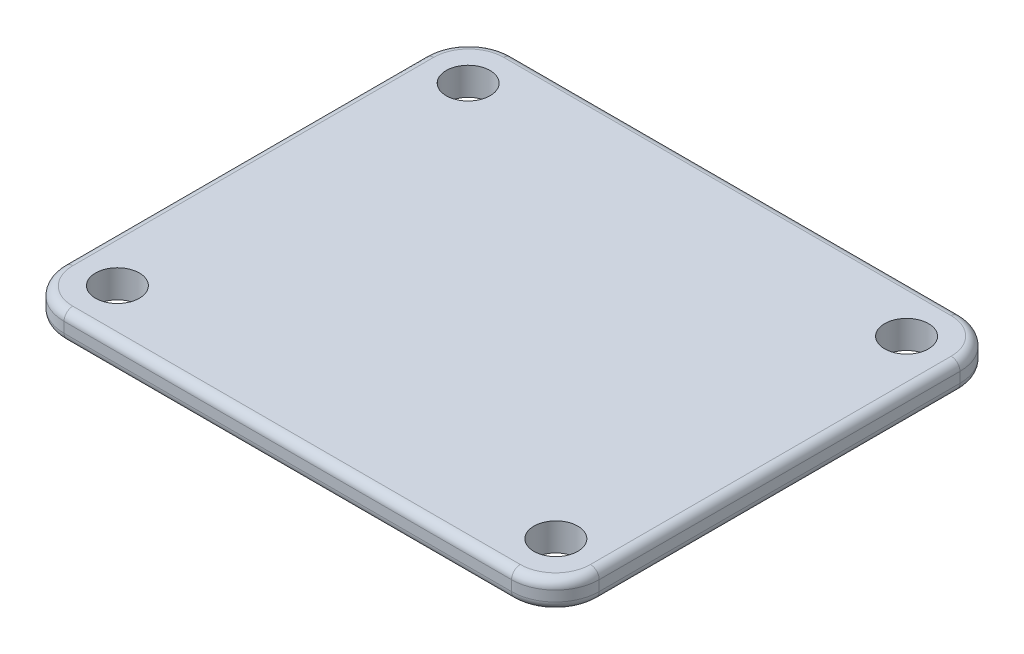
ISO-10303-21;
HEADER;
FILE_DESCRIPTION(('STEP AP214'),'2;1');
FILE_NAME('part.step','',(''),(''),'','','');
FILE_SCHEMA(('AUTOMOTIVE_DESIGN { 1 0 10303 214 1 1 1 1 }'));
ENDSEC;
DATA;
#1=APPLICATION_CONTEXT('core data for automotive mechanical design processes');
#2=APPLICATION_PROTOCOL_DEFINITION('international standard','automotive_design',2000,#1);
#3=PRODUCT_CONTEXT('',#1,'mechanical');
#4=PRODUCT('Part','Part','',(#3));
#5=PRODUCT_RELATED_PRODUCT_CATEGORY('part','',(#4));
#6=PRODUCT_DEFINITION_FORMATION('','',#4);
#7=PRODUCT_DEFINITION_CONTEXT('part definition',#1,'design');
#8=PRODUCT_DEFINITION('design','',#6,#7);
#9=PRODUCT_DEFINITION_SHAPE('','',#8);
#10=(LENGTH_UNIT() NAMED_UNIT(*) SI_UNIT(.MILLI.,.METRE.));
#11=(NAMED_UNIT(*) PLANE_ANGLE_UNIT() SI_UNIT($,.RADIAN.));
#12=(NAMED_UNIT(*) SI_UNIT($,.STERADIAN.) SOLID_ANGLE_UNIT());
#13=UNCERTAINTY_MEASURE_WITH_UNIT(LENGTH_MEASURE(1.E-05),#10,'distance_accuracy_value','');
#14=(GEOMETRIC_REPRESENTATION_CONTEXT(3) GLOBAL_UNCERTAINTY_ASSIGNED_CONTEXT((#13)) GLOBAL_UNIT_ASSIGNED_CONTEXT((#10,
#11,#12)) REPRESENTATION_CONTEXT('',''));
#15=CARTESIAN_POINT('',(0.,0.,0.));
#16=DIRECTION('',(0.,0.,1.));
#17=DIRECTION('',(1.,0.,0.));
#18=AXIS2_PLACEMENT_3D('',#15,#16,#17);
#19=CARTESIAN_POINT('',(-118.732669292731,3.175,-19.5533458649551));
#20=DIRECTION('',(0.,-1.,0.));
#21=DIRECTION('',(0.,0.,-1.));
#22=AXIS2_PLACEMENT_3D('',#19,#20,#21);
#23=PLANE('',#22);
#24=DIRECTION('',(0.,0.,1.));
#25=VECTOR('',#24,1.);
#26=CARTESIAN_POINT('',(-122.732669292731,3.175,-19.5533458649551));
#27=LINE('',#26,#25);
#28=CARTESIAN_POINT('',(-122.732669292731,3.175,-19.5533458649551));
#29=VERTEX_POINT('',#28);
#30=CARTESIAN_POINT('',(-122.732669292731,3.175,21.5906695744132));
#31=VERTEX_POINT('',#30);
#32=EDGE_CURVE('E47',#29,#31,#27,.T.);
#33=ORIENTED_EDGE('',*,*,#32,.T.);
#34=CARTESIAN_POINT('',(-118.732669292731,3.175,21.5906695744133));
#35=DIRECTION('',(0.,-1.,0.));
#36=DIRECTION('',(0.,0.,-1.));
#37=AXIS2_PLACEMENT_3D('',#34,#35,#36);
#38=CIRCLE('',#37,4.);
#39=CARTESIAN_POINT('',(-118.732509427102,3.175,25.5906695712186));
#40=VERTEX_POINT('',#39);
#41=EDGE_CURVE('E154',#31,#40,#38,.F.);
#42=ORIENTED_EDGE('',*,*,#41,.T.);
#43=DIRECTION('',(0.999999999201343,0.,-3.99664072472509E-05));
#44=VECTOR('',#43,1.);
#45=CARTESIAN_POINT('',(-118.730865048626,3.175,25.5906695054987));
#46=LINE('',#45,#44);
#47=CARTESIAN_POINT('',(-67.7014194049255,3.175,25.5886300418909));
#48=VERTEX_POINT('',#47);
#49=EDGE_CURVE('E178',#40,#48,#46,.T.);
#50=ORIENTED_EDGE('',*,*,#49,.T.);
#51=CARTESIAN_POINT('',(-67.7015792705544,3.175,21.5886300450855));
#52=DIRECTION('',(0.,-1.,0.));
#53=DIRECTION('',(0.,0.,-1.));
#54=AXIS2_PLACEMENT_3D('',#51,#52,#53);
#55=CIRCLE('',#54,4.);
#56=CARTESIAN_POINT('',(-63.7015792709717,3.175,21.5885722691979));
#57=VERTEX_POINT('',#56);
#58=EDGE_CURVE('E323',#48,#57,#55,.F.);
#59=ORIENTED_EDGE('',*,*,#58,.T.);
#60=DIRECTION('',(-1.44439718971546E-05,0.,-0.999999999895686));
#61=VECTOR('',#60,1.);
#62=CARTESIAN_POINT('',(-63.702173535162,3.175,-19.5541407238894));
#63=LINE('',#62,#61);
#64=CARTESIAN_POINT('',(-63.7021735269493,3.175,-19.5535721395091));
#65=VERTEX_POINT('',#64);
#66=EDGE_CURVE('E325',#57,#65,#63,.T.);
#67=ORIENTED_EDGE('',*,*,#66,.T.);
#68=CARTESIAN_POINT('',(-67.7021735265321,3.175,-19.5535143636215));
#69=DIRECTION('',(0.,-1.,0.));
#70=DIRECTION('',(0.,0.,-1.));
#71=AXIS2_PLACEMENT_3D('',#68,#69,#70);
#72=CIRCLE('',#71,4.);
#73=CARTESIAN_POINT('',(-67.7021867342162,3.175,-23.5535143635997));
#74=VERTEX_POINT('',#73);
#75=EDGE_CURVE('E327',#65,#74,#72,.F.);
#76=ORIENTED_EDGE('',*,*,#75,.T.);
#77=DIRECTION('',(-0.999999999994549,0.,3.30192101554651E-06));
#78=VECTOR('',#77,1.);
#79=CARTESIAN_POINT('',(-118.732682500415,3.175,-23.5533458649333));
#80=LINE('',#79,#78);
#81=CARTESIAN_POINT('',(-118.732682500415,3.175,-23.5533458649333));
#82=VERTEX_POINT('',#81);
#83=EDGE_CURVE('E329',#74,#82,#80,.T.);
#84=ORIENTED_EDGE('',*,*,#83,.T.);
#85=CARTESIAN_POINT('',(-118.732669292731,3.175,-19.5533458649551));
#86=DIRECTION('',(0.,-1.,0.));
#87=DIRECTION('',(0.,0.,-1.));
#88=AXIS2_PLACEMENT_3D('',#85,#86,#87);
#89=CIRCLE('',#88,4.);
#90=EDGE_CURVE('E52',#82,#29,#89,.F.);
#91=ORIENTED_EDGE('',*,*,#90,.T.);
#92=EDGE_LOOP('',(#33,#42,#50,#59,#67,#76,#84,#91));
#93=FACE_BOUND('',#92,.T.);
#94=CARTESIAN_POINT('',(-118.217169292731,3.175,21.0186489712735));
#95=DIRECTION('',(0.,1.,0.));
#96=DIRECTION('',(0.,0.,1.));
#97=AXIS2_PLACEMENT_3D('',#94,#95,#96);
#98=CIRCLE('',#97,2.49979863735303);
#99=CARTESIAN_POINT('',(-118.217169292731,3.175,23.5184476086265));
#100=VERTEX_POINT('',#99);
#101=EDGE_CURVE('E247',#100,#100,#98,.T.);
#102=ORIENTED_EDGE('',*,*,#101,.F.);
#103=EDGE_LOOP('',(#102));
#104=FACE_BOUND('',#103,.T.);
#105=CARTESIAN_POINT('',(-68.2176652646094,3.175,-18.9815126615054));
#106=DIRECTION('',(0.,1.,0.));
#107=DIRECTION('',(0.,0.,1.));
#108=AXIS2_PLACEMENT_3D('',#105,#106,#107);
#109=CIRCLE('',#108,2.49979863735303);
#110=CARTESIAN_POINT('',(-68.2176652646094,3.175,-16.4817140241524));
#111=VERTEX_POINT('',#110);
#112=EDGE_CURVE('E259',#111,#111,#109,.T.);
#113=ORIENTED_EDGE('',*,*,#112,.F.);
#114=EDGE_LOOP('',(#113));
#115=FACE_BOUND('',#114,.T.);
#116=CARTESIAN_POINT('',(-68.2170875322625,3.175,21.0166506476419));
#117=DIRECTION('',(0.,1.,0.));
#118=DIRECTION('',(0.,0.,1.));
#119=AXIS2_PLACEMENT_3D('',#116,#117,#118);
#120=CIRCLE('',#119,2.49979863735303);
#121=CARTESIAN_POINT('',(-68.2170875322625,3.175,23.5164492849949));
#122=VERTEX_POINT('',#121);
#123=EDGE_CURVE('E253',#122,#122,#120,.T.);
#124=ORIENTED_EDGE('',*,*,#123,.F.);
#125=EDGE_LOOP('',(#124));
#126=FACE_BOUND('',#125,.T.);
#127=CARTESIAN_POINT('',(-118.217169292731,3.175,-18.9813475670923));
#128=DIRECTION('',(0.,1.,0.));
#129=DIRECTION('',(0.,0.,1.));
#130=AXIS2_PLACEMENT_3D('',#127,#128,#129);
#131=CIRCLE('',#130,2.49979863735303);
#132=CARTESIAN_POINT('',(-118.217169292731,3.175,-16.4815489297393));
#133=VERTEX_POINT('',#132);
#134=EDGE_CURVE('E239',#133,#133,#131,.T.);
#135=ORIENTED_EDGE('',*,*,#134,.F.);
#136=EDGE_LOOP('',(#135));
#137=FACE_BOUND('',#136,.T.);
#138=ADVANCED_FACE('F30',(#93,#104,#115,#126,#137),#23,.F.);
#139=CARTESIAN_POINT('',(-118.732669292731,0.,-19.5533458649551));
#140=DIRECTION('',(0.,-1.,0.));
#141=DIRECTION('',(0.,0.,-1.));
#142=AXIS2_PLACEMENT_3D('',#139,#140,#141);
#143=PLANE('',#142);
#144=DIRECTION('',(0.999999999201343,0.,-3.99664072472509E-05));
#145=VECTOR('',#144,1.);
#146=CARTESIAN_POINT('',(-118.732509427102,0.,25.5906695712186));
#147=LINE('',#146,#145);
#148=CARTESIAN_POINT('',(-67.7014194049255,0.,25.5886300418909));
#149=VERTEX_POINT('',#148);
#150=CARTESIAN_POINT('',(-118.732509427102,0.,25.5906695712186));
#151=VERTEX_POINT('',#150);
#152=EDGE_CURVE('E281',#149,#151,#147,.F.);
#153=ORIENTED_EDGE('',*,*,#152,.T.);
#154=CARTESIAN_POINT('',(-118.732669292731,0.,21.5906695744133));
#155=DIRECTION('',(0.,-1.,0.));
#156=DIRECTION('',(0.,0.,-1.));
#157=AXIS2_PLACEMENT_3D('',#154,#155,#156);
#158=CIRCLE('',#157,4.);
#159=CARTESIAN_POINT('',(-122.732669292731,0.,21.5906695744132));
#160=VERTEX_POINT('',#159);
#161=EDGE_CURVE('E295',#151,#160,#158,.T.);
#162=ORIENTED_EDGE('',*,*,#161,.T.);
#163=DIRECTION('',(0.,0.,1.));
#164=VECTOR('',#163,1.);
#165=CARTESIAN_POINT('',(-122.732669292731,0.,-19.5533458649551));
#166=LINE('',#165,#164);
#167=CARTESIAN_POINT('',(-122.732669292731,0.,-19.5533458649551));
#168=VERTEX_POINT('',#167);
#169=EDGE_CURVE('E293',#160,#168,#166,.F.);
#170=ORIENTED_EDGE('',*,*,#169,.T.);
#171=CARTESIAN_POINT('',(-118.732669292731,0.,-19.5533458649551));
#172=DIRECTION('',(0.,-1.,0.));
#173=DIRECTION('',(0.,0.,-1.));
#174=AXIS2_PLACEMENT_3D('',#171,#172,#173);
#175=CIRCLE('',#174,4.);
#176=CARTESIAN_POINT('',(-118.732682500415,0.,-23.5533458649333));
#177=VERTEX_POINT('',#176);
#178=EDGE_CURVE('E291',#168,#177,#175,.T.);
#179=ORIENTED_EDGE('',*,*,#178,.T.);
#180=DIRECTION('',(-0.999999999994549,0.,3.30192101554651E-06));
#181=VECTOR('',#180,1.);
#182=CARTESIAN_POINT('',(-67.7021867342162,0.,-23.5535143635997));
#183=LINE('',#182,#181);
#184=CARTESIAN_POINT('',(-67.7021867342162,0.,-23.5535143635997));
#185=VERTEX_POINT('',#184);
#186=EDGE_CURVE('E289',#177,#185,#183,.F.);
#187=ORIENTED_EDGE('',*,*,#186,.T.);
#188=CARTESIAN_POINT('',(-67.7021735265321,0.,-19.5535143636215));
#189=DIRECTION('',(0.,-1.,0.));
#190=DIRECTION('',(0.,0.,-1.));
#191=AXIS2_PLACEMENT_3D('',#188,#189,#190);
#192=CIRCLE('',#191,4.);
#193=CARTESIAN_POINT('',(-63.7021735269493,0.,-19.5535721395091));
#194=VERTEX_POINT('',#193);
#195=EDGE_CURVE('E287',#185,#194,#192,.T.);
#196=ORIENTED_EDGE('',*,*,#195,.T.);
#197=DIRECTION('',(-1.44439718971546E-05,0.,-0.999999999895686));
#198=VECTOR('',#197,1.);
#199=CARTESIAN_POINT('',(-63.7015792709717,0.,21.5885722691979));
#200=LINE('',#199,#198);
#201=CARTESIAN_POINT('',(-63.7015792709717,0.,21.5885722691979));
#202=VERTEX_POINT('',#201);
#203=EDGE_CURVE('E285',#194,#202,#200,.F.);
#204=ORIENTED_EDGE('',*,*,#203,.T.);
#205=CARTESIAN_POINT('',(-67.7015792705544,0.,21.5886300450855));
#206=DIRECTION('',(0.,-1.,0.));
#207=DIRECTION('',(0.,0.,-1.));
#208=AXIS2_PLACEMENT_3D('',#205,#206,#207);
#209=CIRCLE('',#208,4.);
#210=EDGE_CURVE('E283',#202,#149,#209,.T.);
#211=ORIENTED_EDGE('',*,*,#210,.T.);
#212=EDGE_LOOP('',(#153,#162,#170,#179,#187,#196,#204,#211));
#213=FACE_BOUND('',#212,.T.);
#214=CARTESIAN_POINT('',(-118.217169292731,0.,21.0186489712735));
#215=DIRECTION('',(0.,1.,0.));
#216=DIRECTION('',(0.,0.,1.));
#217=AXIS2_PLACEMENT_3D('',#214,#215,#216);
#218=CIRCLE('',#217,2.49979863735303);
#219=CARTESIAN_POINT('',(-118.217169292731,0.,23.5184476086265));
#220=VERTEX_POINT('',#219);
#221=EDGE_CURVE('E244',#220,#220,#218,.T.);
#222=ORIENTED_EDGE('',*,*,#221,.T.);
#223=EDGE_LOOP('',(#222));
#224=FACE_BOUND('',#223,.T.);
#225=CARTESIAN_POINT('',(-68.2176652646094,0.,-18.9815126615054));
#226=DIRECTION('',(0.,1.,0.));
#227=DIRECTION('',(0.,0.,1.));
#228=AXIS2_PLACEMENT_3D('',#225,#226,#227);
#229=CIRCLE('',#228,2.49979863735303);
#230=CARTESIAN_POINT('',(-68.2176652646094,0.,-16.4817140241524));
#231=VERTEX_POINT('',#230);
#232=EDGE_CURVE('E256',#231,#231,#229,.T.);
#233=ORIENTED_EDGE('',*,*,#232,.T.);
#234=EDGE_LOOP('',(#233));
#235=FACE_BOUND('',#234,.T.);
#236=CARTESIAN_POINT('',(-68.2170875322625,0.,21.0166506476419));
#237=DIRECTION('',(0.,1.,0.));
#238=DIRECTION('',(0.,0.,1.));
#239=AXIS2_PLACEMENT_3D('',#236,#237,#238);
#240=CIRCLE('',#239,2.49979863735303);
#241=CARTESIAN_POINT('',(-68.2170875322625,0.,23.5164492849949));
#242=VERTEX_POINT('',#241);
#243=EDGE_CURVE('E250',#242,#242,#240,.T.);
#244=ORIENTED_EDGE('',*,*,#243,.T.);
#245=EDGE_LOOP('',(#244));
#246=FACE_BOUND('',#245,.T.);
#247=CARTESIAN_POINT('',(-118.217169292731,0.,-18.9813475670923));
#248=DIRECTION('',(0.,1.,0.));
#249=DIRECTION('',(0.,0.,1.));
#250=AXIS2_PLACEMENT_3D('',#247,#248,#249);
#251=CIRCLE('',#250,2.49979863735303);
#252=CARTESIAN_POINT('',(-118.217169292731,0.,-16.4815489297393));
#253=VERTEX_POINT('',#252);
#254=EDGE_CURVE('E233',#253,#253,#251,.T.);
#255=ORIENTED_EDGE('',*,*,#254,.T.);
#256=EDGE_LOOP('',(#255));
#257=FACE_BOUND('',#256,.T.);
#258=ADVANCED_FACE('F379',(#213,#224,#235,#246,#257),#143,.T.);
#259=CARTESIAN_POINT('',(-118.732669292731,3.175,-19.5533458649551));
#260=DIRECTION('',(0.,-1.,0.));
#261=DIRECTION('',(0.,0.,-1.));
#262=AXIS2_PLACEMENT_3D('',#259,#260,#261);
#263=CYLINDRICAL_SURFACE('',#262,5.);
#264=DIRECTION('',(0.,-1.,0.));
#265=VECTOR('',#264,1.);
#266=CARTESIAN_POINT('',(-118.732685802336,3.175,-24.5533458649279));
#267=LINE('',#266,#265);
#268=CARTESIAN_POINT('',(-118.732685802336,2.175,-24.5533458649279));
#269=VERTEX_POINT('',#268);
#270=CARTESIAN_POINT('',(-118.732685802336,1.,-24.5533458649279));
#271=VERTEX_POINT('',#270);
#272=EDGE_CURVE('E262',#269,#271,#267,.T.);
#273=ORIENTED_EDGE('',*,*,#272,.T.);
#274=CARTESIAN_POINT('',(-118.732669292731,1.,-19.5533458649551));
#275=DIRECTION('',(0.,-1.,0.));
#276=DIRECTION('',(0.,0.,-1.));
#277=AXIS2_PLACEMENT_3D('',#274,#275,#276);
#278=CIRCLE('',#277,5.);
#279=CARTESIAN_POINT('',(-123.732669292731,1.,-19.5533458649551));
#280=VERTEX_POINT('',#279);
#281=EDGE_CURVE('E304',#271,#280,#278,.F.);
#282=ORIENTED_EDGE('',*,*,#281,.T.);
#283=DIRECTION('',(0.,-1.,0.));
#284=VECTOR('',#283,1.);
#285=CARTESIAN_POINT('',(-123.732669292731,3.175,-19.5533458649551));
#286=LINE('',#285,#284);
#287=CARTESIAN_POINT('',(-123.732669292731,2.175,-19.5533458649551));
#288=VERTEX_POINT('',#287);
#289=EDGE_CURVE('E175',#288,#280,#286,.T.);
#290=ORIENTED_EDGE('',*,*,#289,.F.);
#291=CARTESIAN_POINT('',(-118.732669292731,2.175,-19.5533458649551));
#292=DIRECTION('',(0.,-1.,0.));
#293=DIRECTION('',(0.,0.,-1.));
#294=AXIS2_PLACEMENT_3D('',#291,#292,#293);
#295=CIRCLE('',#294,5.);
#296=EDGE_CURVE('E302',#288,#269,#295,.T.);
#297=ORIENTED_EDGE('',*,*,#296,.T.);
#298=EDGE_LOOP('',(#273,#282,#290,#297));
#299=FACE_BOUND('',#298,.T.);
#300=ADVANCED_FACE('F355',(#299),#263,.T.);
#301=CARTESIAN_POINT('',(-123.732669292731,3.175,21.5906695744132));
#302=DIRECTION('',(1.,0.,0.));
#303=DIRECTION('',(0.,0.,-1.));
#304=AXIS2_PLACEMENT_3D('',#301,#302,#303);
#305=PLANE('',#304);
#306=ORIENTED_EDGE('',*,*,#289,.T.);
#307=DIRECTION('',(0.,0.,1.));
#308=VECTOR('',#307,1.);
#309=CARTESIAN_POINT('',(-123.732669292731,1.,21.5906695744132));
#310=LINE('',#309,#308);
#311=CARTESIAN_POINT('',(-123.732669292731,1.,21.5906695744132));
#312=VERTEX_POINT('',#311);
#313=EDGE_CURVE('E300',#280,#312,#310,.T.);
#314=ORIENTED_EDGE('',*,*,#313,.T.);
#315=DIRECTION('',(0.,-1.,0.));
#316=VECTOR('',#315,1.);
#317=CARTESIAN_POINT('',(-123.732669292731,3.175,21.5906695744132));
#318=LINE('',#317,#316);
#319=CARTESIAN_POINT('',(-123.732669292731,2.175,21.5906695744132));
#320=VERTEX_POINT('',#319);
#321=EDGE_CURVE('E166',#320,#312,#318,.T.);
#322=ORIENTED_EDGE('',*,*,#321,.F.);
#323=DIRECTION('',(0.,0.,1.));
#324=VECTOR('',#323,1.);
#325=CARTESIAN_POINT('',(-123.732669292731,2.175,21.5906695744132));
#326=LINE('',#325,#324);
#327=EDGE_CURVE('E298',#320,#288,#326,.F.);
#328=ORIENTED_EDGE('',*,*,#327,.T.);
#329=EDGE_LOOP('',(#306,#314,#322,#328));
#330=FACE_BOUND('',#329,.T.);
#331=ADVANCED_FACE('F352',(#330),#305,.F.);
#332=CARTESIAN_POINT('',(-118.732669292731,3.175,21.5906695744133));
#333=DIRECTION('',(0.,-1.,0.));
#334=DIRECTION('',(0.,0.,-1.));
#335=AXIS2_PLACEMENT_3D('',#332,#333,#334);
#336=CYLINDRICAL_SURFACE('',#335,5.);
#337=ORIENTED_EDGE('',*,*,#321,.T.);
#338=CARTESIAN_POINT('',(-118.732669292731,1.,21.5906695744133));
#339=DIRECTION('',(0.,-1.,0.));
#340=DIRECTION('',(0.,0.,-1.));
#341=AXIS2_PLACEMENT_3D('',#338,#339,#340);
#342=CIRCLE('',#341,5.);
#343=CARTESIAN_POINT('',(-118.732469460695,1.,26.59066957042));
#344=VERTEX_POINT('',#343);
#345=EDGE_CURVE('E165',#312,#344,#342,.F.);
#346=ORIENTED_EDGE('',*,*,#345,.T.);
#347=DIRECTION('',(0.,-1.,0.));
#348=VECTOR('',#347,1.);
#349=CARTESIAN_POINT('',(-118.732469460695,3.175,26.59066957042));
#350=LINE('',#349,#348);
#351=CARTESIAN_POINT('',(-118.732469460695,2.175,26.59066957042));
#352=VERTEX_POINT('',#351);
#353=EDGE_CURVE('E147',#352,#344,#350,.T.);
#354=ORIENTED_EDGE('',*,*,#353,.F.);
#355=CARTESIAN_POINT('',(-118.732669292731,2.175,21.5906695744133));
#356=DIRECTION('',(0.,-1.,0.));
#357=DIRECTION('',(0.,0.,-1.));
#358=AXIS2_PLACEMENT_3D('',#355,#356,#357);
#359=CIRCLE('',#358,5.);
#360=EDGE_CURVE('E162',#352,#320,#359,.T.);
#361=ORIENTED_EDGE('',*,*,#360,.T.);
#362=EDGE_LOOP('',(#337,#346,#354,#361));
#363=FACE_BOUND('',#362,.T.);
#364=ADVANCED_FACE('F161',(#363),#336,.T.);
#365=CARTESIAN_POINT('',(-67.7013794385182,3.175,26.5886300410922));
#366=DIRECTION('',(-3.99664072472509E-05,0.,-0.999999999201343));
#367=DIRECTION('',(-0.999999999201343,0.,3.99664072472509E-05));
#368=AXIS2_PLACEMENT_3D('',#365,#366,#367);
#369=PLANE('',#368);
#370=ORIENTED_EDGE('',*,*,#353,.T.);
#371=DIRECTION('',(0.999999999201343,0.,-3.99664072472509E-05));
#372=VECTOR('',#371,1.);
#373=CARTESIAN_POINT('',(-67.7013794385182,1.,26.5886300410922));
#374=LINE('',#373,#372);
#375=CARTESIAN_POINT('',(-67.7013794385182,1.,26.5886300410922));
#376=VERTEX_POINT('',#375);
#377=EDGE_CURVE('E11',#344,#376,#374,.T.);
#378=ORIENTED_EDGE('',*,*,#377,.T.);
#379=DIRECTION('',(0.,-1.,0.));
#380=VECTOR('',#379,1.);
#381=CARTESIAN_POINT('',(-67.7013794385182,3.175,26.5886300410922));
#382=LINE('',#381,#380);
#383=CARTESIAN_POINT('',(-67.7013794385182,2.175,26.5886300410922));
#384=VERTEX_POINT('',#383);
#385=EDGE_CURVE('E149',#384,#376,#382,.T.);
#386=ORIENTED_EDGE('',*,*,#385,.F.);
#387=DIRECTION('',(0.999999999201343,0.,-3.99664072472509E-05));
#388=VECTOR('',#387,1.);
#389=CARTESIAN_POINT('',(-67.7013794385182,2.175,26.5886300410922));
#390=LINE('',#389,#388);
#391=EDGE_CURVE('E39',#384,#352,#390,.F.);
#392=ORIENTED_EDGE('',*,*,#391,.T.);
#393=EDGE_LOOP('',(#370,#378,#386,#392));
#394=FACE_BOUND('',#393,.T.);
#395=ADVANCED_FACE('F146',(#394),#369,.F.);
#396=CARTESIAN_POINT('',(-67.7015792705544,3.175,21.5886300450855));
#397=DIRECTION('',(0.,-1.,0.));
#398=DIRECTION('',(0.,0.,-1.));
#399=AXIS2_PLACEMENT_3D('',#396,#397,#398);
#400=CYLINDRICAL_SURFACE('',#399,5.);
#401=ORIENTED_EDGE('',*,*,#385,.T.);
#402=CARTESIAN_POINT('',(-67.7015792705544,1.,21.5886300450855));
#403=DIRECTION('',(0.,-1.,0.));
#404=DIRECTION('',(0.,0.,-1.));
#405=AXIS2_PLACEMENT_3D('',#402,#403,#404);
#406=CIRCLE('',#405,5.);
#407=CARTESIAN_POINT('',(-62.701579271076,1.,21.588557825226));
#408=VERTEX_POINT('',#407);
#409=EDGE_CURVE('E320',#376,#408,#406,.F.);
#410=ORIENTED_EDGE('',*,*,#409,.T.);
#411=DIRECTION('',(0.,-1.,0.));
#412=VECTOR('',#411,1.);
#413=CARTESIAN_POINT('',(-62.701579271076,3.175,21.588557825226));
#414=LINE('',#413,#412);
#415=CARTESIAN_POINT('',(-62.701579271076,2.175,21.588557825226));
#416=VERTEX_POINT('',#415);
#417=EDGE_CURVE('E273',#416,#408,#414,.T.);
#418=ORIENTED_EDGE('',*,*,#417,.F.);
#419=CARTESIAN_POINT('',(-67.7015792705544,2.175,21.5886300450855));
#420=DIRECTION('',(0.,-1.,0.));
#421=DIRECTION('',(0.,0.,-1.));
#422=AXIS2_PLACEMENT_3D('',#419,#420,#421);
#423=CIRCLE('',#422,5.);
#424=EDGE_CURVE('E318',#416,#384,#423,.T.);
#425=ORIENTED_EDGE('',*,*,#424,.T.);
#426=EDGE_LOOP('',(#401,#410,#418,#425));
#427=FACE_BOUND('',#426,.T.);
#428=ADVANCED_FACE('F402',(#427),#400,.T.);
#429=CARTESIAN_POINT('',(-62.7021735270537,3.175,-19.553586583481));
#430=DIRECTION('',(-0.999999999895686,0.,1.44439718971546E-05));
#431=DIRECTION('',(1.44439718971546E-05,0.,0.999999999895686));
#432=AXIS2_PLACEMENT_3D('',#429,#430,#431);
#433=PLANE('',#432);
#434=ORIENTED_EDGE('',*,*,#417,.T.);
#435=DIRECTION('',(-1.44439718971546E-05,0.,-0.999999999895686));
#436=VECTOR('',#435,1.);
#437=CARTESIAN_POINT('',(-62.7021735270537,1.,-19.553586583481));
#438=LINE('',#437,#436);
#439=CARTESIAN_POINT('',(-62.7021735270537,1.,-19.553586583481));
#440=VERTEX_POINT('',#439);
#441=EDGE_CURVE('E316',#408,#440,#438,.T.);
#442=ORIENTED_EDGE('',*,*,#441,.T.);
#443=DIRECTION('',(0.,-1.,0.));
#444=VECTOR('',#443,1.);
#445=CARTESIAN_POINT('',(-62.7021735270537,3.175,-19.553586583481));
#446=LINE('',#445,#444);
#447=CARTESIAN_POINT('',(-62.7021735270537,2.175,-19.553586583481));
#448=VERTEX_POINT('',#447);
#449=EDGE_CURVE('E270',#448,#440,#446,.T.);
#450=ORIENTED_EDGE('',*,*,#449,.F.);
#451=DIRECTION('',(-1.44439718971546E-05,0.,-0.999999999895686));
#452=VECTOR('',#451,1.);
#453=CARTESIAN_POINT('',(-62.7021735270537,2.175,-19.553586583481));
#454=LINE('',#453,#452);
#455=EDGE_CURVE('E314',#448,#416,#454,.F.);
#456=ORIENTED_EDGE('',*,*,#455,.T.);
#457=EDGE_LOOP('',(#434,#442,#450,#456));
#458=FACE_BOUND('',#457,.T.);
#459=ADVANCED_FACE('F398',(#458),#433,.F.);
#460=CARTESIAN_POINT('',(-67.7021735265321,3.175,-19.5535143636215));
#461=DIRECTION('',(0.,-1.,0.));
#462=DIRECTION('',(0.,0.,-1.));
#463=AXIS2_PLACEMENT_3D('',#460,#461,#462);
#464=CYLINDRICAL_SURFACE('',#463,5.);
#465=ORIENTED_EDGE('',*,*,#449,.T.);
#466=CARTESIAN_POINT('',(-67.7021735265321,1.,-19.5535143636215));
#467=DIRECTION('',(0.,-1.,0.));
#468=DIRECTION('',(0.,0.,-1.));
#469=AXIS2_PLACEMENT_3D('',#466,#467,#468);
#470=CIRCLE('',#469,5.);
#471=CARTESIAN_POINT('',(-67.7021900361372,1.,-24.5535143635943));
#472=VERTEX_POINT('',#471);
#473=EDGE_CURVE('E312',#440,#472,#470,.F.);
#474=ORIENTED_EDGE('',*,*,#473,.T.);
#475=DIRECTION('',(0.,-1.,0.));
#476=VECTOR('',#475,1.);
#477=CARTESIAN_POINT('',(-67.7021900361372,3.175,-24.5535143635943));
#478=LINE('',#477,#476);
#479=CARTESIAN_POINT('',(-67.7021900361372,2.175,-24.5535143635943));
#480=VERTEX_POINT('',#479);
#481=EDGE_CURVE('E267',#480,#472,#478,.T.);
#482=ORIENTED_EDGE('',*,*,#481,.F.);
#483=CARTESIAN_POINT('',(-67.7021735265321,2.175,-19.5535143636215));
#484=DIRECTION('',(0.,-1.,0.));
#485=DIRECTION('',(0.,0.,-1.));
#486=AXIS2_PLACEMENT_3D('',#483,#484,#485);
#487=CIRCLE('',#486,5.);
#488=EDGE_CURVE('E310',#480,#448,#487,.T.);
#489=ORIENTED_EDGE('',*,*,#488,.T.);
#490=EDGE_LOOP('',(#465,#474,#482,#489));
#491=FACE_BOUND('',#490,.T.);
#492=ADVANCED_FACE('F394',(#491),#464,.T.);
#493=CARTESIAN_POINT('',(-118.732685802336,3.175,-24.5533458649279));
#494=DIRECTION('',(3.30192101554651E-06,0.,0.999999999994549));
#495=DIRECTION('',(0.999999999994549,0.,-3.30192101554651E-06));
#496=AXIS2_PLACEMENT_3D('',#493,#494,#495);
#497=PLANE('',#496);
#498=ORIENTED_EDGE('',*,*,#481,.T.);
#499=DIRECTION('',(-0.999999999994549,0.,3.30192101554651E-06));
#500=VECTOR('',#499,1.);
#501=CARTESIAN_POINT('',(-118.732685802336,1.,-24.5533458649279));
#502=LINE('',#501,#500);
#503=EDGE_CURVE('E308',#472,#271,#502,.T.);
#504=ORIENTED_EDGE('',*,*,#503,.T.);
#505=ORIENTED_EDGE('',*,*,#272,.F.);
#506=DIRECTION('',(-0.999999999994549,0.,3.30192101554651E-06));
#507=VECTOR('',#506,1.);
#508=CARTESIAN_POINT('',(-118.732685802336,2.175,-24.5533458649279));
#509=LINE('',#508,#507);
#510=EDGE_CURVE('E306',#269,#480,#509,.F.);
#511=ORIENTED_EDGE('',*,*,#510,.T.);
#512=EDGE_LOOP('',(#498,#504,#505,#511));
#513=FACE_BOUND('',#512,.T.);
#514=ADVANCED_FACE('F391',(#513),#497,.F.);
#515=CARTESIAN_POINT('',(-68.2176652646094,3.175,-18.9815126615054));
#516=DIRECTION('',(0.,-1.,0.));
#517=DIRECTION('',(0.,0.,-1.));
#518=AXIS2_PLACEMENT_3D('',#515,#516,#517);
#519=CYLINDRICAL_SURFACE('',#518,2.49979863735303);
#520=ORIENTED_EDGE('',*,*,#112,.T.);
#521=EDGE_LOOP('',(#520));
#522=FACE_BOUND('',#521,.T.);
#523=ORIENTED_EDGE('',*,*,#232,.F.);
#524=EDGE_LOOP('',(#523));
#525=FACE_BOUND('',#524,.T.);
#526=ADVANCED_FACE('F388',(#522,#525),#519,.F.);
#527=CARTESIAN_POINT('',(-68.2170875322625,3.175,21.0166506476419));
#528=DIRECTION('',(0.,-1.,0.));
#529=DIRECTION('',(0.,0.,-1.));
#530=AXIS2_PLACEMENT_3D('',#527,#528,#529);
#531=CYLINDRICAL_SURFACE('',#530,2.49979863735303);
#532=ORIENTED_EDGE('',*,*,#123,.T.);
#533=EDGE_LOOP('',(#532));
#534=FACE_BOUND('',#533,.T.);
#535=ORIENTED_EDGE('',*,*,#243,.F.);
#536=EDGE_LOOP('',(#535));
#537=FACE_BOUND('',#536,.T.);
#538=ADVANCED_FACE('F593',(#534,#537),#531,.F.);
#539=CARTESIAN_POINT('',(-118.217169292731,3.175,21.0186489712735));
#540=DIRECTION('',(0.,-1.,0.));
#541=DIRECTION('',(0.,0.,-1.));
#542=AXIS2_PLACEMENT_3D('',#539,#540,#541);
#543=CYLINDRICAL_SURFACE('',#542,2.49979863735303);
#544=ORIENTED_EDGE('',*,*,#101,.T.);
#545=EDGE_LOOP('',(#544));
#546=FACE_BOUND('',#545,.T.);
#547=ORIENTED_EDGE('',*,*,#221,.F.);
#548=EDGE_LOOP('',(#547));
#549=FACE_BOUND('',#548,.T.);
#550=ADVANCED_FACE('F595',(#546,#549),#543,.F.);
#551=CARTESIAN_POINT('',(-118.217169292731,3.175,-18.9813475670923));
#552=DIRECTION('',(0.,-1.,0.));
#553=DIRECTION('',(0.,0.,-1.));
#554=AXIS2_PLACEMENT_3D('',#551,#552,#553);
#555=CYLINDRICAL_SURFACE('',#554,2.49979863735303);
#556=ORIENTED_EDGE('',*,*,#134,.T.);
#557=EDGE_LOOP('',(#556));
#558=FACE_BOUND('',#557,.T.);
#559=ORIENTED_EDGE('',*,*,#254,.F.);
#560=EDGE_LOOP('',(#559));
#561=FACE_BOUND('',#560,.T.);
#562=ADVANCED_FACE('F455',(#558,#561),#555,.F.);
#563=CARTESIAN_POINT('',(-67.7021735265321,1.,-19.5535143636215));
#564=DIRECTION('',(0.,-1.,0.));
#565=DIRECTION('',(0.,0.,-1.));
#566=AXIS2_PLACEMENT_3D('',#563,#564,#565);
#567=TOROIDAL_SURFACE('',#566,4.,1.);
#568=CARTESIAN_POINT('',(-63.7021735269494,1.,-19.5535721395091));
#569=DIRECTION('',(1.44439718900712E-05,0.,0.999999999895686));
#570=DIRECTION('',(0.999999999895686,0.,-1.44439718900712E-05));
#571=AXIS2_PLACEMENT_3D('',#568,#569,#570);
#572=CIRCLE('',#571,1.);
#573=EDGE_CURVE('E226',#194,#440,#572,.T.);
#574=ORIENTED_EDGE('',*,*,#573,.F.);
#575=ORIENTED_EDGE('',*,*,#195,.F.);
#576=CARTESIAN_POINT('',(-67.7021867342162,1.,-23.5535143635997));
#577=DIRECTION('',(-0.999999999994549,0.,3.30192102826476E-06));
#578=DIRECTION('',(3.30192102826476E-06,0.,0.999999999994549));
#579=AXIS2_PLACEMENT_3D('',#576,#577,#578);
#580=CIRCLE('',#579,1.);
#581=EDGE_CURVE('E183',#472,#185,#580,.T.);
#582=ORIENTED_EDGE('',*,*,#581,.F.);
#583=ORIENTED_EDGE('',*,*,#473,.F.);
#584=EDGE_LOOP('',(#574,#575,#582,#583));
#585=FACE_BOUND('',#584,.T.);
#586=ADVANCED_FACE('F449',(#585),#567,.T.);
#587=CARTESIAN_POINT('',(-118.732682500415,1.,-23.5533458649333));
#588=DIRECTION('',(0.999999999994549,0.,-3.30192101554651E-06));
#589=DIRECTION('',(-3.30192101554651E-06,0.,-0.999999999994549));
#590=AXIS2_PLACEMENT_3D('',#587,#588,#589);
#591=CYLINDRICAL_SURFACE('',#590,1.);
#592=ORIENTED_EDGE('',*,*,#581,.T.);
#593=ORIENTED_EDGE('',*,*,#186,.F.);
#594=CARTESIAN_POINT('',(-118.732682500415,1.,-23.5533458649333));
#595=DIRECTION('',(-0.999999999994549,0.,3.30192101438697E-06));
#596=DIRECTION('',(3.30192101438697E-06,0.,0.999999999994549));
#597=AXIS2_PLACEMENT_3D('',#594,#595,#596);
#598=CIRCLE('',#597,1.);
#599=EDGE_CURVE('E224',#271,#177,#598,.T.);
#600=ORIENTED_EDGE('',*,*,#599,.F.);
#601=ORIENTED_EDGE('',*,*,#503,.F.);
#602=EDGE_LOOP('',(#592,#593,#600,#601));
#603=FACE_BOUND('',#602,.T.);
#604=ADVANCED_FACE('F454',(#603),#591,.T.);
#605=CARTESIAN_POINT('',(-63.7021735269493,1.,-19.5535721395091));
#606=DIRECTION('',(1.44439718971546E-05,0.,0.999999999895686));
#607=DIRECTION('',(0.999999999895686,0.,-1.44439718971546E-05));
#608=AXIS2_PLACEMENT_3D('',#605,#606,#607);
#609=CYLINDRICAL_SURFACE('',#608,1.);
#610=ORIENTED_EDGE('',*,*,#573,.T.);
#611=ORIENTED_EDGE('',*,*,#441,.F.);
#612=CARTESIAN_POINT('',(-63.7015792709717,1.,21.5885722691979));
#613=DIRECTION('',(1.44439718970103E-05,0.,0.999999999895686));
#614=DIRECTION('',(0.999999999895686,0.,-1.44439718970103E-05));
#615=AXIS2_PLACEMENT_3D('',#612,#613,#614);
#616=CIRCLE('',#615,1.);
#617=EDGE_CURVE('E221',#202,#408,#616,.T.);
#618=ORIENTED_EDGE('',*,*,#617,.F.);
#619=ORIENTED_EDGE('',*,*,#203,.F.);
#620=EDGE_LOOP('',(#610,#611,#618,#619));
#621=FACE_BOUND('',#620,.T.);
#622=ADVANCED_FACE('F467',(#621),#609,.T.);
#623=CARTESIAN_POINT('',(-118.732669292731,1.,-19.5533458649551));
#624=DIRECTION('',(0.,-1.,0.));
#625=DIRECTION('',(0.,0.,-1.));
#626=AXIS2_PLACEMENT_3D('',#623,#624,#625);
#627=TOROIDAL_SURFACE('',#626,4.,1.);
#628=ORIENTED_EDGE('',*,*,#599,.T.);
#629=ORIENTED_EDGE('',*,*,#178,.F.);
#630=CARTESIAN_POINT('',(-122.732669292731,1.,-19.5533458649551));
#631=DIRECTION('',(0.,0.,1.));
#632=DIRECTION('',(0.,-1.,0.));
#633=AXIS2_PLACEMENT_3D('',#630,#631,#632);
#634=CIRCLE('',#633,1.);
#635=EDGE_CURVE('E218',#280,#168,#634,.T.);
#636=ORIENTED_EDGE('',*,*,#635,.F.);
#637=ORIENTED_EDGE('',*,*,#281,.F.);
#638=EDGE_LOOP('',(#628,#629,#636,#637));
#639=FACE_BOUND('',#638,.T.);
#640=ADVANCED_FACE('F360',(#639),#627,.T.);
#641=CARTESIAN_POINT('',(-67.7015792705544,1.,21.5886300450855));
#642=DIRECTION('',(0.,-1.,0.));
#643=DIRECTION('',(0.,0.,-1.));
#644=AXIS2_PLACEMENT_3D('',#641,#642,#643);
#645=TOROIDAL_SURFACE('',#644,4.,1.);
#646=ORIENTED_EDGE('',*,*,#617,.T.);
#647=ORIENTED_EDGE('',*,*,#409,.F.);
#648=CARTESIAN_POINT('',(-67.7014194049255,1.,25.5886300418909));
#649=DIRECTION('',(-0.999999999201343,0.,3.99664072392447E-05));
#650=DIRECTION('',(3.99664072392447E-05,0.,0.999999999201343));
#651=AXIS2_PLACEMENT_3D('',#648,#649,#650);
#652=CIRCLE('',#651,1.);
#653=EDGE_CURVE('E213',#149,#376,#652,.T.);
#654=ORIENTED_EDGE('',*,*,#653,.F.);
#655=ORIENTED_EDGE('',*,*,#210,.F.);
#656=EDGE_LOOP('',(#646,#647,#654,#655));
#657=FACE_BOUND('',#656,.T.);
#658=ADVANCED_FACE('F484',(#657),#645,.T.);
#659=CARTESIAN_POINT('',(-122.732669292731,1.,21.5906695744132));
#660=DIRECTION('',(0.,0.,-1.));
#661=DIRECTION('',(-1.,0.,0.));
#662=AXIS2_PLACEMENT_3D('',#659,#660,#661);
#663=CYLINDRICAL_SURFACE('',#662,1.);
#664=ORIENTED_EDGE('',*,*,#635,.T.);
#665=ORIENTED_EDGE('',*,*,#169,.F.);
#666=CARTESIAN_POINT('',(-122.732669292731,1.,21.5906695744132));
#667=DIRECTION('',(0.,0.,1.));
#668=DIRECTION('',(0.,-1.,0.));
#669=AXIS2_PLACEMENT_3D('',#666,#667,#668);
#670=CIRCLE('',#669,1.);
#671=EDGE_CURVE('E207',#312,#160,#670,.T.);
#672=ORIENTED_EDGE('',*,*,#671,.F.);
#673=ORIENTED_EDGE('',*,*,#313,.F.);
#674=EDGE_LOOP('',(#664,#665,#672,#673));
#675=FACE_BOUND('',#674,.T.);
#676=ADVANCED_FACE('F366',(#675),#663,.T.);
#677=CARTESIAN_POINT('',(-67.7014194049255,1.,25.5886300418909));
#678=DIRECTION('',(-0.999999999201343,0.,3.99664072472509E-05));
#679=DIRECTION('',(3.99664072472509E-05,0.,0.999999999201343));
#680=AXIS2_PLACEMENT_3D('',#677,#678,#679);
#681=CYLINDRICAL_SURFACE('',#680,1.);
#682=ORIENTED_EDGE('',*,*,#653,.T.);
#683=ORIENTED_EDGE('',*,*,#377,.F.);
#684=CARTESIAN_POINT('',(-118.732509427102,1.,25.5906695712186));
#685=DIRECTION('',(-0.999999999201343,0.,3.99664072531225E-05));
#686=DIRECTION('',(3.99664072531225E-05,0.,0.999999999201343));
#687=AXIS2_PLACEMENT_3D('',#684,#685,#686);
#688=CIRCLE('',#687,1.);
#689=EDGE_CURVE('E202',#151,#344,#688,.T.);
#690=ORIENTED_EDGE('',*,*,#689,.F.);
#691=ORIENTED_EDGE('',*,*,#152,.F.);
#692=EDGE_LOOP('',(#682,#683,#690,#691));
#693=FACE_BOUND('',#692,.T.);
#694=ADVANCED_FACE('F369',(#693),#681,.T.);
#695=CARTESIAN_POINT('',(-118.732669292731,1.,21.5906695744133));
#696=DIRECTION('',(0.,-1.,0.));
#697=DIRECTION('',(0.,0.,-1.));
#698=AXIS2_PLACEMENT_3D('',#695,#696,#697);
#699=TOROIDAL_SURFACE('',#698,4.,1.);
#700=ORIENTED_EDGE('',*,*,#671,.T.);
#701=ORIENTED_EDGE('',*,*,#161,.F.);
#702=ORIENTED_EDGE('',*,*,#689,.T.);
#703=ORIENTED_EDGE('',*,*,#345,.F.);
#704=EDGE_LOOP('',(#700,#701,#702,#703));
#705=FACE_BOUND('',#704,.T.);
#706=ADVANCED_FACE('F367',(#705),#699,.T.);
#707=CARTESIAN_POINT('',(-67.7021735265321,2.175,-19.5535143636215));
#708=DIRECTION('',(0.,-1.,0.));
#709=DIRECTION('',(0.,0.,-1.));
#710=AXIS2_PLACEMENT_3D('',#707,#708,#709);
#711=TOROIDAL_SURFACE('',#710,4.,1.);
#712=CARTESIAN_POINT('',(-63.7021735269493,2.175,-19.5535721395091));
#713=DIRECTION('',(1.44439718900714E-05,0.,0.999999999895686));
#714=DIRECTION('',(0.999999999895686,0.,-1.44439718900714E-05));
#715=AXIS2_PLACEMENT_3D('',#712,#713,#714);
#716=CIRCLE('',#715,1.);
#717=EDGE_CURVE('E195',#448,#65,#716,.T.);
#718=ORIENTED_EDGE('',*,*,#717,.F.);
#719=ORIENTED_EDGE('',*,*,#488,.F.);
#720=CARTESIAN_POINT('',(-67.7021867342162,2.175,-23.5535143635997));
#721=DIRECTION('',(-0.999999999994549,0.,3.30192101438698E-06));
#722=DIRECTION('',(3.30192101438698E-06,0.,0.999999999994549));
#723=AXIS2_PLACEMENT_3D('',#720,#721,#722);
#724=CIRCLE('',#723,1.);
#725=EDGE_CURVE('E34',#74,#480,#724,.T.);
#726=ORIENTED_EDGE('',*,*,#725,.F.);
#727=ORIENTED_EDGE('',*,*,#75,.F.);
#728=EDGE_LOOP('',(#718,#719,#726,#727));
#729=FACE_BOUND('',#728,.T.);
#730=ADVANCED_FACE('F32',(#729),#711,.T.);
#731=CARTESIAN_POINT('',(-118.732682500415,2.175,-23.5533458649333));
#732=DIRECTION('',(-0.999999999994549,0.,3.30192101554651E-06));
#733=DIRECTION('',(3.30192101554651E-06,0.,0.999999999994549));
#734=AXIS2_PLACEMENT_3D('',#731,#732,#733);
#735=CYLINDRICAL_SURFACE('',#734,1.);
#736=ORIENTED_EDGE('',*,*,#725,.T.);
#737=ORIENTED_EDGE('',*,*,#510,.F.);
#738=CARTESIAN_POINT('',(-118.732682500415,2.175,-23.5533458649333));
#739=DIRECTION('',(-0.999999999994549,0.,3.30192101438697E-06));
#740=DIRECTION('',(3.30192101438697E-06,0.,0.999999999994549));
#741=AXIS2_PLACEMENT_3D('',#738,#739,#740);
#742=CIRCLE('',#741,1.);
#743=EDGE_CURVE('E193',#82,#269,#742,.T.);
#744=ORIENTED_EDGE('',*,*,#743,.F.);
#745=ORIENTED_EDGE('',*,*,#83,.F.);
#746=EDGE_LOOP('',(#736,#737,#744,#745));
#747=FACE_BOUND('',#746,.T.);
#748=ADVANCED_FACE('F344',(#747),#735,.T.);
#749=CARTESIAN_POINT('',(-63.702173535162,2.175,-19.5541407238894));
#750=DIRECTION('',(-1.44439718971546E-05,0.,-0.999999999895686));
#751=DIRECTION('',(-0.999999999895686,0.,1.44439718971546E-05));
#752=AXIS2_PLACEMENT_3D('',#749,#750,#751);
#753=CYLINDRICAL_SURFACE('',#752,1.);
#754=ORIENTED_EDGE('',*,*,#717,.T.);
#755=ORIENTED_EDGE('',*,*,#66,.F.);
#756=CARTESIAN_POINT('',(-63.7015792709717,2.175,21.5885722691979));
#757=DIRECTION('',(1.44439718970103E-05,0.,0.999999999895686));
#758=DIRECTION('',(0.999999999895686,0.,-1.44439718970103E-05));
#759=AXIS2_PLACEMENT_3D('',#756,#757,#758);
#760=CIRCLE('',#759,1.);
#761=EDGE_CURVE('E190',#416,#57,#760,.T.);
#762=ORIENTED_EDGE('',*,*,#761,.F.);
#763=ORIENTED_EDGE('',*,*,#455,.F.);
#764=EDGE_LOOP('',(#754,#755,#762,#763));
#765=FACE_BOUND('',#764,.T.);
#766=ADVANCED_FACE('F339',(#765),#753,.T.);
#767=CARTESIAN_POINT('',(-118.732669292731,2.175,-19.5533458649551));
#768=DIRECTION('',(0.,-1.,0.));
#769=DIRECTION('',(0.,0.,-1.));
#770=AXIS2_PLACEMENT_3D('',#767,#768,#769);
#771=TOROIDAL_SURFACE('',#770,4.,1.);
#772=ORIENTED_EDGE('',*,*,#743,.T.);
#773=ORIENTED_EDGE('',*,*,#296,.F.);
#774=CARTESIAN_POINT('',(-122.732669292731,2.175,-19.5533458649551));
#775=DIRECTION('',(0.,0.,1.));
#776=DIRECTION('',(1.,0.,0.));
#777=AXIS2_PLACEMENT_3D('',#774,#775,#776);
#778=CIRCLE('',#777,1.);
#779=EDGE_CURVE('E187',#29,#288,#778,.T.);
#780=ORIENTED_EDGE('',*,*,#779,.F.);
#781=ORIENTED_EDGE('',*,*,#90,.F.);
#782=EDGE_LOOP('',(#772,#773,#780,#781));
#783=FACE_BOUND('',#782,.T.);
#784=ADVANCED_FACE('F347',(#783),#771,.T.);
#785=CARTESIAN_POINT('',(-67.7015792705544,2.175,21.5886300450855));
#786=DIRECTION('',(0.,-1.,0.));
#787=DIRECTION('',(0.,0.,-1.));
#788=AXIS2_PLACEMENT_3D('',#785,#786,#787);
#789=TOROIDAL_SURFACE('',#788,4.,1.);
#790=ORIENTED_EDGE('',*,*,#761,.T.);
#791=ORIENTED_EDGE('',*,*,#58,.F.);
#792=CARTESIAN_POINT('',(-67.7014194049255,2.175,25.5886300418909));
#793=DIRECTION('',(-0.999999999201343,0.,3.99664072392447E-05));
#794=DIRECTION('',(3.99664072392447E-05,0.,0.999999999201343));
#795=AXIS2_PLACEMENT_3D('',#792,#793,#794);
#796=CIRCLE('',#795,1.);
#797=EDGE_CURVE('E180',#384,#48,#796,.T.);
#798=ORIENTED_EDGE('',*,*,#797,.F.);
#799=ORIENTED_EDGE('',*,*,#424,.F.);
#800=EDGE_LOOP('',(#790,#791,#798,#799));
#801=FACE_BOUND('',#800,.T.);
#802=ADVANCED_FACE('F336',(#801),#789,.T.);
#803=CARTESIAN_POINT('',(-122.732669292731,2.175,-19.5533458649551));
#804=DIRECTION('',(0.,0.,1.));
#805=DIRECTION('',(1.,0.,0.));
#806=AXIS2_PLACEMENT_3D('',#803,#804,#805);
#807=CYLINDRICAL_SURFACE('',#806,1.);
#808=ORIENTED_EDGE('',*,*,#779,.T.);
#809=ORIENTED_EDGE('',*,*,#327,.F.);
#810=CARTESIAN_POINT('',(-122.732669292731,2.175,21.5906695744132));
#811=DIRECTION('',(0.,0.,1.));
#812=DIRECTION('',(1.,0.,0.));
#813=AXIS2_PLACEMENT_3D('',#810,#811,#812);
#814=CIRCLE('',#813,1.);
#815=EDGE_CURVE('E173',#31,#320,#814,.T.);
#816=ORIENTED_EDGE('',*,*,#815,.F.);
#817=ORIENTED_EDGE('',*,*,#32,.F.);
#818=EDGE_LOOP('',(#808,#809,#816,#817));
#819=FACE_BOUND('',#818,.T.);
#820=ADVANCED_FACE('F349',(#819),#807,.T.);
#821=CARTESIAN_POINT('',(-118.730865048626,2.175,25.5906695054987));
#822=DIRECTION('',(0.999999999201343,0.,-3.99664072472509E-05));
#823=DIRECTION('',(-3.99664072472509E-05,0.,-0.999999999201343));
#824=AXIS2_PLACEMENT_3D('',#821,#822,#823);
#825=CYLINDRICAL_SURFACE('',#824,1.);
#826=ORIENTED_EDGE('',*,*,#797,.T.);
#827=ORIENTED_EDGE('',*,*,#49,.F.);
#828=CARTESIAN_POINT('',(-118.732509427102,2.175,25.5906695712186));
#829=DIRECTION('',(-0.999999999201343,0.,3.99664072531225E-05));
#830=DIRECTION('',(3.99664072531225E-05,0.,0.999999999201343));
#831=AXIS2_PLACEMENT_3D('',#828,#829,#830);
#832=CIRCLE('',#831,1.);
#833=EDGE_CURVE('E171',#352,#40,#832,.T.);
#834=ORIENTED_EDGE('',*,*,#833,.F.);
#835=ORIENTED_EDGE('',*,*,#391,.F.);
#836=EDGE_LOOP('',(#826,#827,#834,#835));
#837=FACE_BOUND('',#836,.T.);
#838=ADVANCED_FACE('F177',(#837),#825,.T.);
#839=CARTESIAN_POINT('',(-118.732669292731,2.175,21.5906695744133));
#840=DIRECTION('',(0.,-1.,0.));
#841=DIRECTION('',(0.,0.,-1.));
#842=AXIS2_PLACEMENT_3D('',#839,#840,#841);
#843=TOROIDAL_SURFACE('',#842,4.,1.);
#844=ORIENTED_EDGE('',*,*,#815,.T.);
#845=ORIENTED_EDGE('',*,*,#360,.F.);
#846=ORIENTED_EDGE('',*,*,#833,.T.);
#847=ORIENTED_EDGE('',*,*,#41,.F.);
#848=EDGE_LOOP('',(#844,#845,#846,#847));
#849=FACE_BOUND('',#848,.T.);
#850=ADVANCED_FACE('F169',(#849),#843,.T.);
#851=CLOSED_SHELL('',(#138,#258,#300,#331,#364,#395,#428,#459,#492,#514,#526,#538,#550,#562,
#586,#604,#622,#640,#658,#676,#694,#706,#730,#748,#766,#784,#802,#820,#838,#850));
#852=MANIFOLD_SOLID_BREP('B2',#851);
#853=ADVANCED_BREP_SHAPE_REPRESENTATION('',(#18,#852),#14);
#854=SHAPE_DEFINITION_REPRESENTATION(#9,#853);
ENDSEC;
END-ISO-10303-21;
